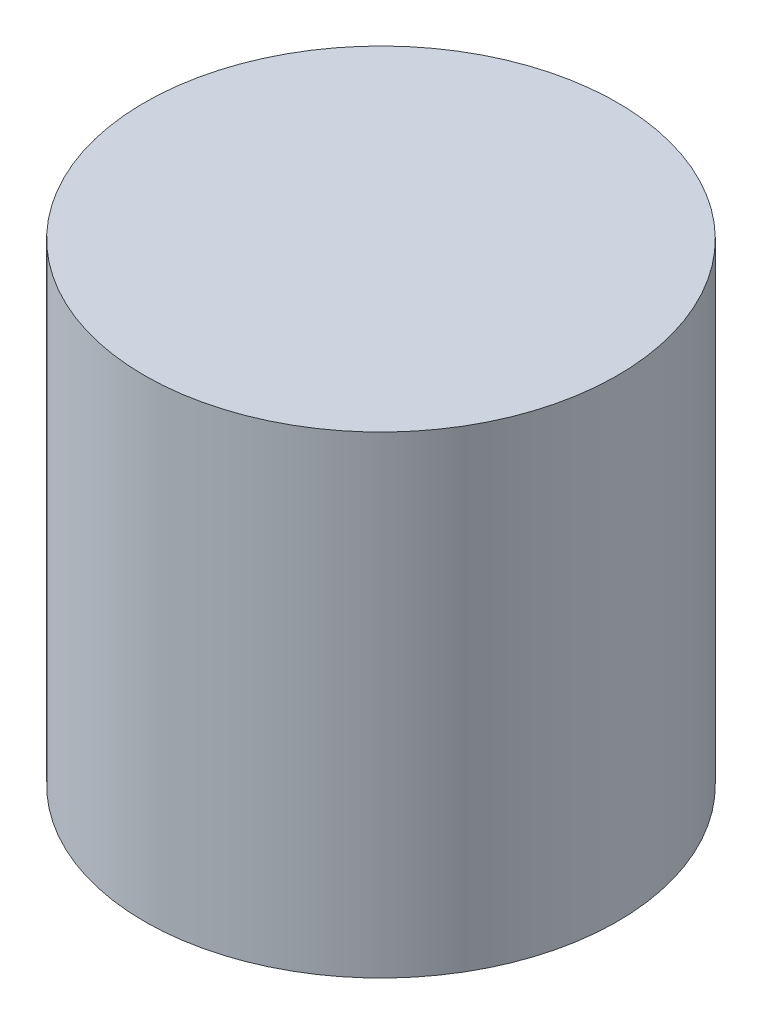
ISO-10303-21;
HEADER;
FILE_DESCRIPTION(('STEP AP214'),'2;1');
FILE_NAME('part.step','',(''),(''),'','','');
FILE_SCHEMA(('AUTOMOTIVE_DESIGN { 1 0 10303 214 1 1 1 1 }'));
ENDSEC;
DATA;
#1=APPLICATION_CONTEXT('core data for automotive mechanical design processes');
#2=APPLICATION_PROTOCOL_DEFINITION('international standard','automotive_design',2000,#1);
#3=PRODUCT_CONTEXT('',#1,'mechanical');
#4=PRODUCT('Part','Part','',(#3));
#5=PRODUCT_RELATED_PRODUCT_CATEGORY('part','',(#4));
#6=PRODUCT_DEFINITION_FORMATION('','',#4);
#7=PRODUCT_DEFINITION_CONTEXT('part definition',#1,'design');
#8=PRODUCT_DEFINITION('design','',#6,#7);
#9=PRODUCT_DEFINITION_SHAPE('','',#8);
#10=(LENGTH_UNIT() NAMED_UNIT(*) SI_UNIT(.MILLI.,.METRE.));
#11=(NAMED_UNIT(*) PLANE_ANGLE_UNIT() SI_UNIT($,.RADIAN.));
#12=(NAMED_UNIT(*) SI_UNIT($,.STERADIAN.) SOLID_ANGLE_UNIT());
#13=UNCERTAINTY_MEASURE_WITH_UNIT(LENGTH_MEASURE(1.E-05),#10,'distance_accuracy_value','');
#14=(GEOMETRIC_REPRESENTATION_CONTEXT(3) GLOBAL_UNCERTAINTY_ASSIGNED_CONTEXT((#13)) GLOBAL_UNIT_ASSIGNED_CONTEXT((#10,
#11,#12)) REPRESENTATION_CONTEXT('',''));
#15=CARTESIAN_POINT('',(0.,0.,0.));
#16=DIRECTION('',(0.,0.,1.));
#17=DIRECTION('',(1.,0.,0.));
#18=AXIS2_PLACEMENT_3D('',#15,#16,#17);
#19=CARTESIAN_POINT('',(0.,-12.,0.));
#20=DIRECTION('',(0.,1.,0.));
#21=DIRECTION('',(0.,0.,1.));
#22=AXIS2_PLACEMENT_3D('',#19,#20,#21);
#23=CONICAL_SURFACE('',#22,5.,0.0183354153607432);
#24=CARTESIAN_POINT('',(0.,-9.00050426705708,0.));
#25=DIRECTION('',(0.,1.,0.));
#26=DIRECTION('',(0.,0.,1.));
#27=AXIS2_PLACEMENT_3D('',#24,#25,#26);
#28=CIRCLE('',#27,5.05500316406571);
#29=CARTESIAN_POINT('',(0.,-9.00050426705708,5.05500316406571));
#30=VERTEX_POINT('',#29);
#31=EDGE_CURVE('E69',#30,#30,#28,.T.);
#32=ORIENTED_EDGE('',*,*,#31,.T.);
#33=EDGE_LOOP('',(#32));
#34=FACE_BOUND('',#33,.T.);
#35=CARTESIAN_POINT('',(0.,-12.,0.));
#36=DIRECTION('',(0.,1.,0.));
#37=DIRECTION('',(0.,0.,1.));
#38=AXIS2_PLACEMENT_3D('',#35,#36,#37);
#39=CIRCLE('',#38,5.);
#40=CARTESIAN_POINT('',(0.,-12.,5.));
#41=VERTEX_POINT('',#40);
#42=EDGE_CURVE('E11',#41,#41,#39,.T.);
#43=ORIENTED_EDGE('',*,*,#42,.F.);
#44=EDGE_LOOP('',(#43));
#45=FACE_BOUND('',#44,.T.);
#46=ADVANCED_FACE('F48',(#34,#45),#23,.F.);
#47=CARTESIAN_POINT('',(0.,-12.,5.));
#48=DIRECTION('',(0.,-1.,0.));
#49=DIRECTION('',(0.,0.,-1.));
#50=AXIS2_PLACEMENT_3D('',#47,#48,#49);
#51=PLANE('',#50);
#52=ORIENTED_EDGE('',*,*,#42,.T.);
#53=EDGE_LOOP('',(#52));
#54=FACE_BOUND('',#53,.T.);
#55=CARTESIAN_POINT('',(0.,-12.,0.));
#56=DIRECTION('',(0.,1.,0.));
#57=DIRECTION('',(0.,0.,1.));
#58=AXIS2_PLACEMENT_3D('',#55,#56,#57);
#59=CIRCLE('',#58,6.);
#60=CARTESIAN_POINT('',(0.,-12.,6.));
#61=VERTEX_POINT('',#60);
#62=EDGE_CURVE('E55',#61,#61,#59,.T.);
#63=ORIENTED_EDGE('',*,*,#62,.F.);
#64=EDGE_LOOP('',(#63));
#65=FACE_BOUND('',#64,.T.);
#66=ADVANCED_FACE('F93',(#54,#65),#51,.T.);
#67=CARTESIAN_POINT('',(0.,88.1324841101695,0.));
#68=DIRECTION('',(0.,1.,0.));
#69=DIRECTION('',(0.,0.,1.));
#70=AXIS2_PLACEMENT_3D('',#67,#68,#69);
#71=CYLINDRICAL_SURFACE('',#70,6.);
#72=ORIENTED_EDGE('',*,*,#62,.T.);
#73=EDGE_LOOP('',(#72));
#74=FACE_BOUND('',#73,.T.);
#75=CARTESIAN_POINT('',(0.,0.,0.));
#76=DIRECTION('',(0.,1.,0.));
#77=DIRECTION('',(0.,0.,1.));
#78=AXIS2_PLACEMENT_3D('',#75,#76,#77);
#79=CIRCLE('',#78,6.);
#80=CARTESIAN_POINT('',(0.,0.,6.));
#81=VERTEX_POINT('',#80);
#82=EDGE_CURVE('E83',#81,#81,#79,.T.);
#83=ORIENTED_EDGE('',*,*,#82,.F.);
#84=EDGE_LOOP('',(#83));
#85=FACE_BOUND('',#84,.T.);
#86=ADVANCED_FACE('F90',(#74,#85),#71,.T.);
#87=CARTESIAN_POINT('',(0.,0.,6.));
#88=DIRECTION('',(0.,1.,0.));
#89=DIRECTION('',(0.,0.,1.));
#90=AXIS2_PLACEMENT_3D('',#87,#88,#89);
#91=PLANE('',#90);
#92=ORIENTED_EDGE('',*,*,#82,.T.);
#93=EDGE_LOOP('',(#92));
#94=FACE_BOUND('',#93,.T.);
#95=ADVANCED_FACE('F100',(#94),#91,.T.);
#96=CARTESIAN_POINT('',(0.,-8.37366129272836,0.));
#97=DIRECTION('',(0.,-1.,0.));
#98=DIRECTION('',(0.,0.,-1.));
#99=AXIS2_PLACEMENT_3D('',#96,#97,#98);
#100=PLANE('',#99);
#101=CARTESIAN_POINT('',(0.,-8.37366129272836,0.));
#102=DIRECTION('',(0.,-1.,0.));
#103=DIRECTION('',(0.,0.,-1.));
#104=AXIS2_PLACEMENT_3D('',#101,#102,#103);
#105=CIRCLE('',#104,1.24999999999999);
#106=CARTESIAN_POINT('',(0.,-8.37366129272836,-1.24999999999999));
#107=VERTEX_POINT('',#106);
#108=EDGE_CURVE('E70',#107,#107,#105,.T.);
#109=ORIENTED_EDGE('',*,*,#108,.F.);
#110=EDGE_LOOP('',(#109));
#111=FACE_BOUND('',#110,.T.);
#112=CARTESIAN_POINT('',(0.,-8.37366129272836,0.));
#113=DIRECTION('',(0.,1.,0.));
#114=DIRECTION('',(0.,0.,1.));
#115=AXIS2_PLACEMENT_3D('',#112,#113,#114);
#116=CIRCLE('',#115,1.5);
#117=CARTESIAN_POINT('',(0.,-8.37366129272836,1.5));
#118=VERTEX_POINT('',#117);
#119=EDGE_CURVE('E75',#118,#118,#116,.T.);
#120=ORIENTED_EDGE('',*,*,#119,.F.);
#121=EDGE_LOOP('',(#120));
#122=FACE_BOUND('',#121,.T.);
#123=ADVANCED_FACE('F106',(#111,#122),#100,.T.);
#124=CARTESIAN_POINT('',(0.,-9.00050426705708,0.));
#125=DIRECTION('',(0.,-1.,0.));
#126=DIRECTION('',(0.,0.,-1.));
#127=AXIS2_PLACEMENT_3D('',#124,#125,#126);
#128=CONICAL_SURFACE('',#127,5.05500316406571,1.39626340159547);
#129=ORIENTED_EDGE('',*,*,#119,.T.);
#130=EDGE_LOOP('',(#129));
#131=FACE_BOUND('',#130,.T.);
#132=ORIENTED_EDGE('',*,*,#31,.F.);
#133=EDGE_LOOP('',(#132));
#134=FACE_BOUND('',#133,.T.);
#135=ADVANCED_FACE('F62',(#131,#134),#128,.F.);
#136=CARTESIAN_POINT('',(0.,-3.50366129272836,0.));
#137=DIRECTION('',(0.,-1.,0.));
#138=DIRECTION('',(0.,0.,-1.));
#139=AXIS2_PLACEMENT_3D('',#136,#137,#138);
#140=CONICAL_SURFACE('',#139,1.25,1.02974425867665);
#141=CARTESIAN_POINT('',(0.,-2.75258551894391,0.));
#142=VERTEX_POINT('',#141);
#143=VERTEX_LOOP('',#142);
#144=FACE_BOUND('',#143,.T.);
#145=CARTESIAN_POINT('',(0.,-3.50366129272836,0.));
#146=DIRECTION('',(0.,-1.,0.));
#147=DIRECTION('',(0.,0.,-1.));
#148=AXIS2_PLACEMENT_3D('',#145,#146,#147);
#149=CIRCLE('',#148,1.25);
#150=CARTESIAN_POINT('',(0.,-3.50366129272836,-1.25));
#151=VERTEX_POINT('',#150);
#152=EDGE_CURVE('E66',#151,#151,#149,.T.);
#153=ORIENTED_EDGE('',*,*,#152,.T.);
#154=EDGE_LOOP('',(#153));
#155=FACE_BOUND('',#154,.T.);
#156=ADVANCED_FACE('F58',(#144,#155),#140,.F.);
#157=CARTESIAN_POINT('',(0.,-8.37366129272836,0.));
#158=DIRECTION('',(0.,-1.,0.));
#159=DIRECTION('',(0.,0.,-1.));
#160=AXIS2_PLACEMENT_3D('',#157,#158,#159);
#161=CYLINDRICAL_SURFACE('',#160,1.24999999999999);
#162=ORIENTED_EDGE('',*,*,#152,.F.);
#163=EDGE_LOOP('',(#162));
#164=FACE_BOUND('',#163,.T.);
#165=ORIENTED_EDGE('',*,*,#108,.T.);
#166=EDGE_LOOP('',(#165));
#167=FACE_BOUND('',#166,.T.);
#168=ADVANCED_FACE('F61',(#164,#167),#161,.F.);
#169=CLOSED_SHELL('',(#46,#66,#86,#95,#123,#135,#156,#168));
#170=MANIFOLD_SOLID_BREP('B2',#169);
#171=ADVANCED_BREP_SHAPE_REPRESENTATION('',(#18,#170),#14);
#172=SHAPE_DEFINITION_REPRESENTATION(#9,#171);
ENDSEC;
END-ISO-10303-21;
